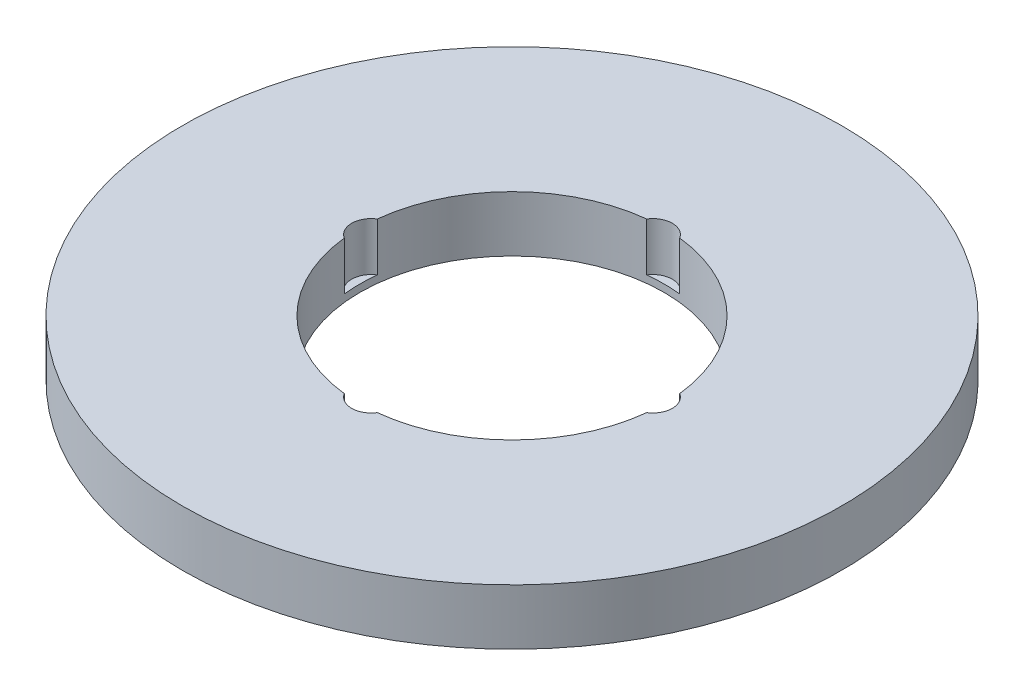
ISO-10303-21;
HEADER;
FILE_DESCRIPTION(('STEP AP214'),'2;1');
FILE_NAME('part.step','',(''),(''),'','','');
FILE_SCHEMA(('AUTOMOTIVE_DESIGN { 1 0 10303 214 1 1 1 1 }'));
ENDSEC;
DATA;
#1=APPLICATION_CONTEXT('core data for automotive mechanical design processes');
#2=APPLICATION_PROTOCOL_DEFINITION('international standard','automotive_design',2000,#1);
#3=PRODUCT_CONTEXT('',#1,'mechanical');
#4=PRODUCT('Part','Part','',(#3));
#5=PRODUCT_RELATED_PRODUCT_CATEGORY('part','',(#4));
#6=PRODUCT_DEFINITION_FORMATION('','',#4);
#7=PRODUCT_DEFINITION_CONTEXT('part definition',#1,'design');
#8=PRODUCT_DEFINITION('design','',#6,#7);
#9=PRODUCT_DEFINITION_SHAPE('','',#8);
#10=(LENGTH_UNIT() NAMED_UNIT(*) SI_UNIT(.MILLI.,.METRE.));
#11=(NAMED_UNIT(*) PLANE_ANGLE_UNIT() SI_UNIT($,.RADIAN.));
#12=(NAMED_UNIT(*) SI_UNIT($,.STERADIAN.) SOLID_ANGLE_UNIT());
#13=UNCERTAINTY_MEASURE_WITH_UNIT(LENGTH_MEASURE(1.E-05),#10,'distance_accuracy_value','');
#14=(GEOMETRIC_REPRESENTATION_CONTEXT(3) GLOBAL_UNCERTAINTY_ASSIGNED_CONTEXT((#13)) GLOBAL_UNIT_ASSIGNED_CONTEXT((#10,
#11,#12)) REPRESENTATION_CONTEXT('',''));
#15=CARTESIAN_POINT('',(0.,0.,0.));
#16=DIRECTION('',(0.,0.,1.));
#17=DIRECTION('',(1.,0.,0.));
#18=AXIS2_PLACEMENT_3D('',#15,#16,#17);
#19=CARTESIAN_POINT('',(0.,11.,0.));
#20=DIRECTION('',(0.,-1.,0.));
#21=DIRECTION('',(0.,0.,-1.));
#22=AXIS2_PLACEMENT_3D('',#19,#20,#21);
#23=CYLINDRICAL_SURFACE('',#22,65.);
#24=CARTESIAN_POINT('',(0.,11.,0.));
#25=DIRECTION('',(0.,1.,0.));
#26=DIRECTION('',(0.,0.,1.));
#27=AXIS2_PLACEMENT_3D('',#24,#25,#26);
#28=CIRCLE('',#27,65.);
#29=CARTESIAN_POINT('',(0.,11.,65.));
#30=VERTEX_POINT('',#29);
#31=EDGE_CURVE('E148',#30,#30,#28,.T.);
#32=ORIENTED_EDGE('',*,*,#31,.F.);
#33=EDGE_LOOP('',(#32));
#34=FACE_BOUND('',#33,.T.);
#35=CARTESIAN_POINT('',(0.,0.,0.));
#36=DIRECTION('',(0.,1.,0.));
#37=DIRECTION('',(0.,0.,1.));
#38=AXIS2_PLACEMENT_3D('',#35,#36,#37);
#39=CIRCLE('',#38,65.);
#40=CARTESIAN_POINT('',(0.,0.,65.));
#41=VERTEX_POINT('',#40);
#42=EDGE_CURVE('E139',#41,#41,#39,.T.);
#43=ORIENTED_EDGE('',*,*,#42,.T.);
#44=EDGE_LOOP('',(#43));
#45=FACE_BOUND('',#44,.T.);
#46=ADVANCED_FACE('F39',(#34,#45),#23,.T.);
#47=CARTESIAN_POINT('',(0.,11.,0.));
#48=DIRECTION('',(0.,1.,0.));
#49=DIRECTION('',(0.,0.,1.));
#50=AXIS2_PLACEMENT_3D('',#47,#48,#49);
#51=PLANE('',#50);
#52=CARTESIAN_POINT('',(0.,11.,27.7727640897784));
#53=DIRECTION('',(0.,1.,0.));
#54=DIRECTION('',(1.,0.,0.));
#55=AXIS2_PLACEMENT_3D('',#52,#53,#54);
#56=CIRCLE('',#55,3.84724294961151);
#57=CARTESIAN_POINT('',(-3.25553155905552,11.,29.822835449836));
#58=VERTEX_POINT('',#57);
#59=CARTESIAN_POINT('',(3.25553155905573,11.,29.822835449836));
#60=VERTEX_POINT('',#59);
#61=EDGE_CURVE('E175',#58,#60,#56,.T.);
#62=ORIENTED_EDGE('',*,*,#61,.F.);
#63=CARTESIAN_POINT('',(0.,11.,0.));
#64=DIRECTION('',(0.,1.,0.));
#65=DIRECTION('',(0.,0.,1.));
#66=AXIS2_PLACEMENT_3D('',#63,#64,#65);
#67=CIRCLE('',#66,30.);
#68=CARTESIAN_POINT('',(-29.822835449836,11.,3.25553155905563));
#69=VERTEX_POINT('',#68);
#70=EDGE_CURVE('E134',#69,#58,#67,.T.);
#71=ORIENTED_EDGE('',*,*,#70,.F.);
#72=CARTESIAN_POINT('',(-27.7727640897784,11.,0.));
#73=DIRECTION('',(0.,1.,0.));
#74=DIRECTION('',(0.,0.,1.));
#75=AXIS2_PLACEMENT_3D('',#72,#73,#74);
#76=CIRCLE('',#75,3.84724294961151);
#77=CARTESIAN_POINT('',(-29.822835449836,11.,-3.25553155905563));
#78=VERTEX_POINT('',#77);
#79=EDGE_CURVE('E143',#78,#69,#76,.T.);
#80=ORIENTED_EDGE('',*,*,#79,.F.);
#81=CARTESIAN_POINT('',(-3.25553155905594,11.,-29.8228354498359));
#82=VERTEX_POINT('',#81);
#83=EDGE_CURVE('E123',#82,#78,#67,.T.);
#84=ORIENTED_EDGE('',*,*,#83,.F.);
#85=CARTESIAN_POINT('',(-2.90904262642662E-13,11.,-27.7727640897784));
#86=DIRECTION('',(0.,1.,0.));
#87=DIRECTION('',(-1.,0.,0.));
#88=AXIS2_PLACEMENT_3D('',#85,#86,#87);
#89=CIRCLE('',#88,3.84724294961151);
#90=CARTESIAN_POINT('',(3.25553155905531,11.,-29.822835449836));
#91=VERTEX_POINT('',#90);
#92=EDGE_CURVE('E106',#91,#82,#89,.T.);
#93=ORIENTED_EDGE('',*,*,#92,.F.);
#94=CARTESIAN_POINT('',(29.822835449836,11.,-3.25553155905563));
#95=VERTEX_POINT('',#94);
#96=EDGE_CURVE('E125',#95,#91,#67,.T.);
#97=ORIENTED_EDGE('',*,*,#96,.F.);
#98=CARTESIAN_POINT('',(27.7727640897784,11.,0.));
#99=DIRECTION('',(0.,1.,0.));
#100=DIRECTION('',(0.,0.,-1.));
#101=AXIS2_PLACEMENT_3D('',#98,#99,#100);
#102=CIRCLE('',#101,3.84724294961151);
#103=CARTESIAN_POINT('',(29.822835449836,11.,3.25553155905563));
#104=VERTEX_POINT('',#103);
#105=EDGE_CURVE('E286',#104,#95,#102,.T.);
#106=ORIENTED_EDGE('',*,*,#105,.F.);
#107=EDGE_CURVE('E135',#60,#104,#67,.T.);
#108=ORIENTED_EDGE('',*,*,#107,.F.);
#109=EDGE_LOOP('',(#62,#71,#80,#84,#93,#97,#106,#108));
#110=FACE_BOUND('',#109,.T.);
#111=ORIENTED_EDGE('',*,*,#31,.T.);
#112=EDGE_LOOP('',(#111));
#113=FACE_BOUND('',#112,.T.);
#114=ADVANCED_FACE('F118',(#110,#113),#51,.T.);
#115=CARTESIAN_POINT('',(0.,0.,0.));
#116=DIRECTION('',(0.,1.,0.));
#117=DIRECTION('',(0.,0.,1.));
#118=AXIS2_PLACEMENT_3D('',#115,#116,#117);
#119=PLANE('',#118);
#120=CARTESIAN_POINT('',(0.,0.,0.));
#121=DIRECTION('',(0.,1.,0.));
#122=DIRECTION('',(0.,0.,1.));
#123=AXIS2_PLACEMENT_3D('',#120,#121,#122);
#124=CIRCLE('',#123,30.);
#125=CARTESIAN_POINT('',(0.,0.,30.));
#126=VERTEX_POINT('',#125);
#127=EDGE_CURVE('E136',#126,#126,#124,.T.);
#128=ORIENTED_EDGE('',*,*,#127,.T.);
#129=EDGE_LOOP('',(#128));
#130=FACE_BOUND('',#129,.T.);
#131=ORIENTED_EDGE('',*,*,#42,.F.);
#132=EDGE_LOOP('',(#131));
#133=FACE_BOUND('',#132,.T.);
#134=ADVANCED_FACE('F187',(#130,#133),#119,.F.);
#135=CARTESIAN_POINT('',(0.,11.,0.));
#136=DIRECTION('',(0.,-1.,0.));
#137=DIRECTION('',(0.,0.,-1.));
#138=AXIS2_PLACEMENT_3D('',#135,#136,#137);
#139=CYLINDRICAL_SURFACE('',#138,30.);
#140=DIRECTION('',(0.,1.,0.));
#141=VECTOR('',#140,1.);
#142=CARTESIAN_POINT('',(-3.25553155905552,6.2201893146116,29.822835449836));
#143=LINE('',#142,#141);
#144=CARTESIAN_POINT('',(-3.25553155905552,1.4403786292232,29.822835449836));
#145=VERTEX_POINT('',#144);
#146=EDGE_CURVE('E11',#145,#58,#143,.T.);
#147=ORIENTED_EDGE('',*,*,#146,.F.);
#148=CARTESIAN_POINT('',(0.,1.4403786292232,0.));
#149=DIRECTION('',(0.,1.,0.));
#150=DIRECTION('',(0.,0.,1.));
#151=AXIS2_PLACEMENT_3D('',#148,#149,#150);
#152=CIRCLE('',#151,30.);
#153=CARTESIAN_POINT('',(3.25553155905573,1.4403786292232,29.822835449836));
#154=VERTEX_POINT('',#153);
#155=EDGE_CURVE('E170',#145,#154,#152,.T.);
#156=ORIENTED_EDGE('',*,*,#155,.T.);
#157=DIRECTION('',(0.,1.,0.));
#158=VECTOR('',#157,1.);
#159=CARTESIAN_POINT('',(3.25553155905573,6.2201893146116,29.822835449836));
#160=LINE('',#159,#158);
#161=EDGE_CURVE('E46',#60,#154,#160,.F.);
#162=ORIENTED_EDGE('',*,*,#161,.F.);
#163=ORIENTED_EDGE('',*,*,#107,.T.);
#164=DIRECTION('',(0.,1.,0.));
#165=VECTOR('',#164,1.);
#166=CARTESIAN_POINT('',(29.822835449836,6.2201893146116,3.25553155905563));
#167=LINE('',#166,#165);
#168=CARTESIAN_POINT('',(29.822835449836,1.4403786292232,3.25553155905563));
#169=VERTEX_POINT('',#168);
#170=EDGE_CURVE('E164',#169,#104,#167,.T.);
#171=ORIENTED_EDGE('',*,*,#170,.F.);
#172=CARTESIAN_POINT('',(0.,1.4403786292232,0.));
#173=DIRECTION('',(0.,1.,0.));
#174=DIRECTION('',(0.,0.,1.));
#175=AXIS2_PLACEMENT_3D('',#172,#173,#174);
#176=CIRCLE('',#175,30.);
#177=CARTESIAN_POINT('',(29.822835449836,1.4403786292232,-3.25553155905563));
#178=VERTEX_POINT('',#177);
#179=EDGE_CURVE('E115',#169,#178,#176,.T.);
#180=ORIENTED_EDGE('',*,*,#179,.T.);
#181=DIRECTION('',(0.,1.,0.));
#182=VECTOR('',#181,1.);
#183=CARTESIAN_POINT('',(29.822835449836,6.2201893146116,-3.25553155905563));
#184=LINE('',#183,#182);
#185=EDGE_CURVE('E131',#95,#178,#184,.F.);
#186=ORIENTED_EDGE('',*,*,#185,.F.);
#187=ORIENTED_EDGE('',*,*,#96,.T.);
#188=DIRECTION('',(0.,1.,0.));
#189=VECTOR('',#188,1.);
#190=CARTESIAN_POINT('',(3.25553155905531,6.2201893146116,-29.822835449836));
#191=LINE('',#190,#189);
#192=CARTESIAN_POINT('',(3.25553155905531,1.4403786292232,-29.822835449836));
#193=VERTEX_POINT('',#192);
#194=EDGE_CURVE('E105',#193,#91,#191,.T.);
#195=ORIENTED_EDGE('',*,*,#194,.F.);
#196=CARTESIAN_POINT('',(0.,1.4403786292232,0.));
#197=DIRECTION('',(0.,1.,0.));
#198=DIRECTION('',(0.,0.,1.));
#199=AXIS2_PLACEMENT_3D('',#196,#197,#198);
#200=CIRCLE('',#199,30.);
#201=CARTESIAN_POINT('',(-3.25553155905594,1.4403786292232,-29.8228354498359));
#202=VERTEX_POINT('',#201);
#203=EDGE_CURVE('E159',#193,#202,#200,.T.);
#204=ORIENTED_EDGE('',*,*,#203,.T.);
#205=DIRECTION('',(0.,1.,0.));
#206=VECTOR('',#205,1.);
#207=CARTESIAN_POINT('',(-3.25553155905594,6.2201893146116,-29.8228354498359));
#208=LINE('',#207,#206);
#209=EDGE_CURVE('E114',#82,#202,#208,.F.);
#210=ORIENTED_EDGE('',*,*,#209,.F.);
#211=ORIENTED_EDGE('',*,*,#83,.T.);
#212=DIRECTION('',(0.,1.,0.));
#213=VECTOR('',#212,1.);
#214=CARTESIAN_POINT('',(-29.822835449836,6.2201893146116,-3.25553155905563));
#215=LINE('',#214,#213);
#216=CARTESIAN_POINT('',(-29.822835449836,1.4403786292232,-3.25553155905563));
#217=VERTEX_POINT('',#216);
#218=EDGE_CURVE('E160',#217,#78,#215,.T.);
#219=ORIENTED_EDGE('',*,*,#218,.F.);
#220=CARTESIAN_POINT('',(0.,1.4403786292232,0.));
#221=DIRECTION('',(0.,1.,0.));
#222=DIRECTION('',(0.,0.,1.));
#223=AXIS2_PLACEMENT_3D('',#220,#221,#222);
#224=CIRCLE('',#223,30.);
#225=CARTESIAN_POINT('',(-29.822835449836,1.4403786292232,3.25553155905563));
#226=VERTEX_POINT('',#225);
#227=EDGE_CURVE('E149',#217,#226,#224,.T.);
#228=ORIENTED_EDGE('',*,*,#227,.T.);
#229=DIRECTION('',(0.,1.,0.));
#230=VECTOR('',#229,1.);
#231=CARTESIAN_POINT('',(-29.822835449836,6.2201893146116,3.25553155905563));
#232=LINE('',#231,#230);
#233=EDGE_CURVE('E152',#69,#226,#232,.F.);
#234=ORIENTED_EDGE('',*,*,#233,.F.);
#235=ORIENTED_EDGE('',*,*,#70,.T.);
#236=EDGE_LOOP('',(#147,#156,#162,#163,#171,#180,#186,#187,#195,#204,#210,#211,#219,#228,#234,#235));
#237=FACE_BOUND('',#236,.T.);
#238=ORIENTED_EDGE('',*,*,#127,.F.);
#239=EDGE_LOOP('',(#238));
#240=FACE_BOUND('',#239,.T.);
#241=ADVANCED_FACE('F126',(#237,#240),#139,.F.);
#242=CARTESIAN_POINT('',(-27.7727640897784,1.4403786292232,0.));
#243=DIRECTION('',(0.,1.,0.));
#244=DIRECTION('',(0.,0.,1.));
#245=AXIS2_PLACEMENT_3D('',#242,#243,#244);
#246=CYLINDRICAL_SURFACE('',#245,3.84724294961151);
#247=ORIENTED_EDGE('',*,*,#218,.T.);
#248=ORIENTED_EDGE('',*,*,#79,.T.);
#249=ORIENTED_EDGE('',*,*,#233,.T.);
#250=CARTESIAN_POINT('',(-27.7727640897784,1.4403786292232,0.));
#251=DIRECTION('',(0.,1.,0.));
#252=DIRECTION('',(0.,0.,1.));
#253=AXIS2_PLACEMENT_3D('',#250,#251,#252);
#254=CIRCLE('',#253,3.84724294961151);
#255=EDGE_CURVE('E144',#217,#226,#254,.T.);
#256=ORIENTED_EDGE('',*,*,#255,.F.);
#257=EDGE_LOOP('',(#247,#248,#249,#256));
#258=FACE_BOUND('',#257,.T.);
#259=ADVANCED_FACE('F200',(#258),#246,.F.);
#260=CARTESIAN_POINT('',(-27.7727640897784,1.4403786292232,0.));
#261=DIRECTION('',(0.,1.,0.));
#262=DIRECTION('',(0.,0.,1.));
#263=AXIS2_PLACEMENT_3D('',#260,#261,#262);
#264=PLANE('',#263);
#265=ORIENTED_EDGE('',*,*,#255,.T.);
#266=ORIENTED_EDGE('',*,*,#227,.F.);
#267=EDGE_LOOP('',(#265,#266));
#268=FACE_BOUND('',#267,.T.);
#269=ADVANCED_FACE('F201',(#268),#264,.T.);
#270=CARTESIAN_POINT('',(-2.90904262642662E-13,1.4403786292232,-27.7727640897784));
#271=DIRECTION('',(0.,1.,0.));
#272=DIRECTION('',(0.,0.,1.));
#273=AXIS2_PLACEMENT_3D('',#270,#271,#272);
#274=CYLINDRICAL_SURFACE('',#273,3.84724294961151);
#275=ORIENTED_EDGE('',*,*,#194,.T.);
#276=ORIENTED_EDGE('',*,*,#92,.T.);
#277=ORIENTED_EDGE('',*,*,#209,.T.);
#278=CARTESIAN_POINT('',(-2.90904262642662E-13,1.4403786292232,-27.7727640897784));
#279=DIRECTION('',(0.,1.,0.));
#280=DIRECTION('',(-1.,0.,0.));
#281=AXIS2_PLACEMENT_3D('',#278,#279,#280);
#282=CIRCLE('',#281,3.84724294961151);
#283=EDGE_CURVE('E107',#193,#202,#282,.T.);
#284=ORIENTED_EDGE('',*,*,#283,.F.);
#285=EDGE_LOOP('',(#275,#276,#277,#284));
#286=FACE_BOUND('',#285,.T.);
#287=ADVANCED_FACE('F102',(#286),#274,.F.);
#288=CARTESIAN_POINT('',(-2.90904262642662E-13,1.4403786292232,-27.7727640897784));
#289=DIRECTION('',(0.,1.,0.));
#290=DIRECTION('',(-1.,0.,0.));
#291=AXIS2_PLACEMENT_3D('',#288,#289,#290);
#292=PLANE('',#291);
#293=ORIENTED_EDGE('',*,*,#283,.T.);
#294=ORIENTED_EDGE('',*,*,#203,.F.);
#295=EDGE_LOOP('',(#293,#294));
#296=FACE_BOUND('',#295,.T.);
#297=ADVANCED_FACE('F209',(#296),#292,.T.);
#298=CARTESIAN_POINT('',(27.7727640897784,1.4403786292232,0.));
#299=DIRECTION('',(0.,1.,0.));
#300=DIRECTION('',(0.,0.,1.));
#301=AXIS2_PLACEMENT_3D('',#298,#299,#300);
#302=CYLINDRICAL_SURFACE('',#301,3.84724294961151);
#303=ORIENTED_EDGE('',*,*,#170,.T.);
#304=ORIENTED_EDGE('',*,*,#105,.T.);
#305=ORIENTED_EDGE('',*,*,#185,.T.);
#306=CARTESIAN_POINT('',(27.7727640897784,1.4403786292232,0.));
#307=DIRECTION('',(0.,1.,0.));
#308=DIRECTION('',(0.,0.,-1.));
#309=AXIS2_PLACEMENT_3D('',#306,#307,#308);
#310=CIRCLE('',#309,3.84724294961151);
#311=EDGE_CURVE('E56',#169,#178,#310,.T.);
#312=ORIENTED_EDGE('',*,*,#311,.F.);
#313=EDGE_LOOP('',(#303,#304,#305,#312));
#314=FACE_BOUND('',#313,.T.);
#315=ADVANCED_FACE('F213',(#314),#302,.F.);
#316=CARTESIAN_POINT('',(27.7727640897784,1.4403786292232,0.));
#317=DIRECTION('',(0.,1.,0.));
#318=DIRECTION('',(0.,0.,-1.));
#319=AXIS2_PLACEMENT_3D('',#316,#317,#318);
#320=PLANE('',#319);
#321=ORIENTED_EDGE('',*,*,#311,.T.);
#322=ORIENTED_EDGE('',*,*,#179,.F.);
#323=EDGE_LOOP('',(#321,#322));
#324=FACE_BOUND('',#323,.T.);
#325=ADVANCED_FACE('F179',(#324),#320,.T.);
#326=CARTESIAN_POINT('',(0.,1.4403786292232,27.7727640897784));
#327=DIRECTION('',(0.,1.,0.));
#328=DIRECTION('',(0.,0.,1.));
#329=AXIS2_PLACEMENT_3D('',#326,#327,#328);
#330=CYLINDRICAL_SURFACE('',#329,3.84724294961151);
#331=ORIENTED_EDGE('',*,*,#146,.T.);
#332=ORIENTED_EDGE('',*,*,#61,.T.);
#333=ORIENTED_EDGE('',*,*,#161,.T.);
#334=CARTESIAN_POINT('',(0.,1.4403786292232,27.7727640897784));
#335=DIRECTION('',(0.,1.,0.));
#336=DIRECTION('',(1.,0.,0.));
#337=AXIS2_PLACEMENT_3D('',#334,#335,#336);
#338=CIRCLE('',#337,3.84724294961151);
#339=EDGE_CURVE('E55',#145,#154,#338,.T.);
#340=ORIENTED_EDGE('',*,*,#339,.F.);
#341=EDGE_LOOP('',(#331,#332,#333,#340));
#342=FACE_BOUND('',#341,.T.);
#343=ADVANCED_FACE('F171',(#342),#330,.F.);
#344=CARTESIAN_POINT('',(0.,1.4403786292232,27.7727640897784));
#345=DIRECTION('',(0.,1.,0.));
#346=DIRECTION('',(1.,0.,0.));
#347=AXIS2_PLACEMENT_3D('',#344,#345,#346);
#348=PLANE('',#347);
#349=ORIENTED_EDGE('',*,*,#339,.T.);
#350=ORIENTED_EDGE('',*,*,#155,.F.);
#351=EDGE_LOOP('',(#349,#350));
#352=FACE_BOUND('',#351,.T.);
#353=ADVANCED_FACE('F173',(#352),#348,.T.);
#354=CLOSED_SHELL('',(#46,#114,#134,#241,#259,#269,#287,#297,#315,#325,#343,#353));
#355=MANIFOLD_SOLID_BREP('B2',#354);
#356=ADVANCED_BREP_SHAPE_REPRESENTATION('',(#18,#355),#14);
#357=SHAPE_DEFINITION_REPRESENTATION(#9,#356);
ENDSEC;
END-ISO-10303-21;
